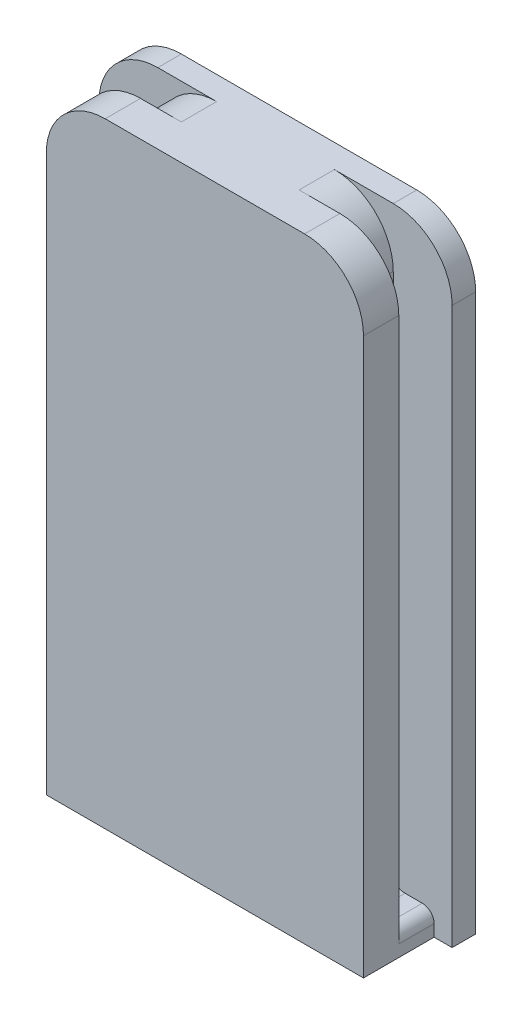
ISO-10303-21;
HEADER;
FILE_DESCRIPTION(('STEP AP214'),'2;1');
FILE_NAME('part.step','',(''),(''),'','','');
FILE_SCHEMA(('AUTOMOTIVE_DESIGN { 1 0 10303 214 1 1 1 1 }'));
ENDSEC;
DATA;
#1=APPLICATION_CONTEXT('core data for automotive mechanical design processes');
#2=APPLICATION_PROTOCOL_DEFINITION('international standard','automotive_design',2000,#1);
#3=PRODUCT_CONTEXT('',#1,'mechanical');
#4=PRODUCT('Part','Part','',(#3));
#5=PRODUCT_RELATED_PRODUCT_CATEGORY('part','',(#4));
#6=PRODUCT_DEFINITION_FORMATION('','',#4);
#7=PRODUCT_DEFINITION_CONTEXT('part definition',#1,'design');
#8=PRODUCT_DEFINITION('design','',#6,#7);
#9=PRODUCT_DEFINITION_SHAPE('','',#8);
#10=(LENGTH_UNIT() NAMED_UNIT(*) SI_UNIT(.MILLI.,.METRE.));
#11=(NAMED_UNIT(*) PLANE_ANGLE_UNIT() SI_UNIT($,.RADIAN.));
#12=(NAMED_UNIT(*) SI_UNIT($,.STERADIAN.) SOLID_ANGLE_UNIT());
#13=UNCERTAINTY_MEASURE_WITH_UNIT(LENGTH_MEASURE(1.E-05),#10,'distance_accuracy_value','');
#14=(GEOMETRIC_REPRESENTATION_CONTEXT(3) GLOBAL_UNCERTAINTY_ASSIGNED_CONTEXT((#13)) GLOBAL_UNIT_ASSIGNED_CONTEXT((#10,
#11,#12)) REPRESENTATION_CONTEXT('',''));
#15=CARTESIAN_POINT('',(0.,0.,0.));
#16=DIRECTION('',(0.,0.,1.));
#17=DIRECTION('',(1.,0.,0.));
#18=AXIS2_PLACEMENT_3D('',#15,#16,#17);
#19=CARTESIAN_POINT('',(-13.4701919815265,52.2437736392464,0.));
#20=DIRECTION('',(1.,0.,0.));
#21=DIRECTION('',(0.,0.,-1.));
#22=AXIS2_PLACEMENT_3D('',#19,#20,#21);
#23=PLANE('',#22);
#24=DIRECTION('',(0.,-1.,0.));
#25=VECTOR('',#24,1.);
#26=CARTESIAN_POINT('',(-13.4701919815265,52.2437736392464,0.));
#27=LINE('',#26,#25);
#28=CARTESIAN_POINT('',(-13.4701919815265,47.2437736392464,0.));
#29=VERTEX_POINT('',#28);
#30=CARTESIAN_POINT('',(-13.4701919815265,0.,0.));
#31=VERTEX_POINT('',#30);
#32=EDGE_CURVE('E265',#29,#31,#27,.T.);
#33=ORIENTED_EDGE('',*,*,#32,.F.);
#34=DIRECTION('',(0.,0.,1.));
#35=VECTOR('',#34,1.);
#36=CARTESIAN_POINT('',(-13.4701919815265,47.2437736392464,0.));
#37=LINE('',#36,#35);
#38=CARTESIAN_POINT('',(-13.4701919815265,47.2437736392464,-3.));
#39=VERTEX_POINT('',#38);
#40=EDGE_CURVE('E56',#29,#39,#37,.F.);
#41=ORIENTED_EDGE('',*,*,#40,.T.);
#42=DIRECTION('',(0.,-1.,0.));
#43=VECTOR('',#42,1.);
#44=CARTESIAN_POINT('',(-13.4701919815265,52.2437736392464,-3.));
#45=LINE('',#44,#43);
#46=CARTESIAN_POINT('',(-13.4701919815265,1.,-3.));
#47=VERTEX_POINT('',#46);
#48=EDGE_CURVE('E240',#39,#47,#45,.T.);
#49=ORIENTED_EDGE('',*,*,#48,.T.);
#50=DIRECTION('',(0.,0.,-1.));
#51=VECTOR('',#50,1.);
#52=CARTESIAN_POINT('',(-13.4701919815265,1.,-6.));
#53=LINE('',#52,#51);
#54=CARTESIAN_POINT('',(-13.4701919815265,1.,-6.));
#55=VERTEX_POINT('',#54);
#56=EDGE_CURVE('E326',#47,#55,#53,.T.);
#57=ORIENTED_EDGE('',*,*,#56,.T.);
#58=DIRECTION('',(0.,1.,0.));
#59=VECTOR('',#58,1.);
#60=CARTESIAN_POINT('',(-13.4701919815265,52.2437736392464,-6.));
#61=LINE('',#60,#59);
#62=CARTESIAN_POINT('',(-13.4701919815265,0.,-6.));
#63=VERTEX_POINT('',#62);
#64=EDGE_CURVE('E210',#63,#55,#61,.T.);
#65=ORIENTED_EDGE('',*,*,#64,.F.);
#66=DIRECTION('',(0.,0.,1.));
#67=VECTOR('',#66,1.);
#68=CARTESIAN_POINT('',(-13.4701919815265,0.,0.));
#69=LINE('',#68,#67);
#70=EDGE_CURVE('E453',#63,#31,#69,.T.);
#71=ORIENTED_EDGE('',*,*,#70,.T.);
#72=EDGE_LOOP('',(#33,#41,#49,#57,#65,#71));
#73=FACE_BOUND('',#72,.T.);
#74=ADVANCED_FACE('F33',(#73),#23,.F.);
#75=CARTESIAN_POINT('',(13.4701919815265,52.2437736392464,0.));
#76=DIRECTION('',(0.,0.,-1.));
#77=DIRECTION('',(-1.,0.,0.));
#78=AXIS2_PLACEMENT_3D('',#75,#76,#77);
#79=PLANE('',#78);
#80=DIRECTION('',(1.,0.,0.));
#81=VECTOR('',#80,1.);
#82=CARTESIAN_POINT('',(13.4701919815265,52.2437736392464,0.));
#83=LINE('',#82,#81);
#84=CARTESIAN_POINT('',(-8.47019198152647,52.2437736392464,0.));
#85=VERTEX_POINT('',#84);
#86=CARTESIAN_POINT('',(8.47019198152648,52.2437736392464,0.));
#87=VERTEX_POINT('',#86);
#88=EDGE_CURVE('E239',#85,#87,#83,.T.);
#89=ORIENTED_EDGE('',*,*,#88,.F.);
#90=CARTESIAN_POINT('',(-8.47019198152648,47.2437736392464,0.));
#91=DIRECTION('',(0.,0.,-1.));
#92=DIRECTION('',(-1.,0.,0.));
#93=AXIS2_PLACEMENT_3D('',#90,#91,#92);
#94=CIRCLE('',#93,5.);
#95=EDGE_CURVE('E356',#85,#29,#94,.F.);
#96=ORIENTED_EDGE('',*,*,#95,.T.);
#97=ORIENTED_EDGE('',*,*,#32,.T.);
#98=DIRECTION('',(1.,0.,0.));
#99=VECTOR('',#98,1.);
#100=CARTESIAN_POINT('',(13.4701919815265,0.,0.));
#101=LINE('',#100,#99);
#102=CARTESIAN_POINT('',(13.4701919815265,0.,0.));
#103=VERTEX_POINT('',#102);
#104=EDGE_CURVE('E220',#31,#103,#101,.T.);
#105=ORIENTED_EDGE('',*,*,#104,.T.);
#106=DIRECTION('',(0.,-1.,0.));
#107=VECTOR('',#106,1.);
#108=CARTESIAN_POINT('',(13.4701919815265,52.2437736392464,0.));
#109=LINE('',#108,#107);
#110=CARTESIAN_POINT('',(13.4701919815265,47.2437736392464,0.));
#111=VERTEX_POINT('',#110);
#112=EDGE_CURVE('E216',#111,#103,#109,.T.);
#113=ORIENTED_EDGE('',*,*,#112,.F.);
#114=CARTESIAN_POINT('',(8.47019198152648,47.2437736392464,0.));
#115=DIRECTION('',(0.,0.,-1.));
#116=DIRECTION('',(-1.,0.,0.));
#117=AXIS2_PLACEMENT_3D('',#114,#115,#116);
#118=CIRCLE('',#117,5.);
#119=EDGE_CURVE('E354',#111,#87,#118,.F.);
#120=ORIENTED_EDGE('',*,*,#119,.T.);
#121=EDGE_LOOP('',(#89,#96,#97,#105,#113,#120));
#122=FACE_BOUND('',#121,.T.);
#123=ADVANCED_FACE('F380',(#122),#79,.F.);
#124=CARTESIAN_POINT('',(13.4701919815265,52.2437736392464,0.));
#125=DIRECTION('',(-1.,0.,0.));
#126=DIRECTION('',(0.,0.,1.));
#127=AXIS2_PLACEMENT_3D('',#124,#125,#126);
#128=PLANE('',#127);
#129=DIRECTION('',(0.,-1.,0.));
#130=VECTOR('',#129,1.);
#131=CARTESIAN_POINT('',(13.4701919815265,52.2437736392464,-3.));
#132=LINE('',#131,#130);
#133=CARTESIAN_POINT('',(13.4701919815265,47.2437736392464,-3.));
#134=VERTEX_POINT('',#133);
#135=CARTESIAN_POINT('',(13.4701919815265,1.,-3.));
#136=VERTEX_POINT('',#135);
#137=EDGE_CURVE('E262',#134,#136,#132,.T.);
#138=ORIENTED_EDGE('',*,*,#137,.F.);
#139=DIRECTION('',(0.,0.,-1.));
#140=VECTOR('',#139,1.);
#141=CARTESIAN_POINT('',(13.4701919815265,47.2437736392464,0.));
#142=LINE('',#141,#140);
#143=EDGE_CURVE('E362',#134,#111,#142,.F.);
#144=ORIENTED_EDGE('',*,*,#143,.T.);
#145=ORIENTED_EDGE('',*,*,#112,.T.);
#146=DIRECTION('',(0.,0.,-1.));
#147=VECTOR('',#146,1.);
#148=CARTESIAN_POINT('',(13.4701919815265,0.,0.));
#149=LINE('',#148,#147);
#150=CARTESIAN_POINT('',(13.4701919815265,0.,-6.));
#151=VERTEX_POINT('',#150);
#152=EDGE_CURVE('E213',#103,#151,#149,.T.);
#153=ORIENTED_EDGE('',*,*,#152,.T.);
#154=DIRECTION('',(0.,-1.,0.));
#155=VECTOR('',#154,1.);
#156=CARTESIAN_POINT('',(13.4701919815265,52.2437736392464,-6.));
#157=LINE('',#156,#155);
#158=CARTESIAN_POINT('',(13.4701919815265,1.,-6.));
#159=VERTEX_POINT('',#158);
#160=EDGE_CURVE('E195',#159,#151,#157,.T.);
#161=ORIENTED_EDGE('',*,*,#160,.F.);
#162=DIRECTION('',(0.,0.,1.));
#163=VECTOR('',#162,1.);
#164=CARTESIAN_POINT('',(13.4701919815265,1.,-3.));
#165=LINE('',#164,#163);
#166=EDGE_CURVE('E313',#159,#136,#165,.T.);
#167=ORIENTED_EDGE('',*,*,#166,.T.);
#168=EDGE_LOOP('',(#138,#144,#145,#153,#161,#167));
#169=FACE_BOUND('',#168,.T.);
#170=ADVANCED_FACE('F214',(#169),#128,.F.);
#171=CARTESIAN_POINT('',(13.4701919815265,52.2437736392464,-3.));
#172=DIRECTION('',(0.,0.,1.));
#173=DIRECTION('',(1.,0.,0.));
#174=AXIS2_PLACEMENT_3D('',#171,#172,#173);
#175=PLANE('',#174);
#176=DIRECTION('',(-1.,0.,0.));
#177=VECTOR('',#176,1.);
#178=CARTESIAN_POINT('',(13.4701919815265,52.2437736392464,-3.));
#179=LINE('',#178,#177);
#180=CARTESIAN_POINT('',(8.47019198152648,52.2437736392464,-3.));
#181=VERTEX_POINT('',#180);
#182=CARTESIAN_POINT('',(5.,52.2437736392464,-2.99999999999999));
#183=VERTEX_POINT('',#182);
#184=EDGE_CURVE('E442',#181,#183,#179,.T.);
#185=ORIENTED_EDGE('',*,*,#184,.F.);
#186=CARTESIAN_POINT('',(8.47019198152648,47.2437736392464,-3.));
#187=DIRECTION('',(0.,0.,1.));
#188=DIRECTION('',(1.,0.,0.));
#189=AXIS2_PLACEMENT_3D('',#186,#187,#188);
#190=CIRCLE('',#189,5.);
#191=EDGE_CURVE('E48',#181,#134,#190,.F.);
#192=ORIENTED_EDGE('',*,*,#191,.T.);
#193=ORIENTED_EDGE('',*,*,#137,.T.);
#194=CARTESIAN_POINT('',(12.4701919815265,1.,-3.));
#195=DIRECTION('',(0.,0.,1.));
#196=DIRECTION('',(1.,0.,0.));
#197=AXIS2_PLACEMENT_3D('',#194,#195,#196);
#198=CIRCLE('',#197,1.);
#199=CARTESIAN_POINT('',(12.4701919815265,2.,-3.));
#200=VERTEX_POINT('',#199);
#201=EDGE_CURVE('E340',#136,#200,#198,.T.);
#202=ORIENTED_EDGE('',*,*,#201,.T.);
#203=DIRECTION('',(-1.,0.,0.));
#204=VECTOR('',#203,1.);
#205=CARTESIAN_POINT('',(13.4701919815265,2.,-3.));
#206=LINE('',#205,#204);
#207=CARTESIAN_POINT('',(11.,2.,-3.));
#208=VERTEX_POINT('',#207);
#209=EDGE_CURVE('E447',#200,#208,#206,.T.);
#210=ORIENTED_EDGE('',*,*,#209,.T.);
#211=CARTESIAN_POINT('',(11.,3.,-3.));
#212=DIRECTION('',(0.,0.,1.));
#213=DIRECTION('',(1.,0.,0.));
#214=AXIS2_PLACEMENT_3D('',#211,#212,#213);
#215=CIRCLE('',#214,1.);
#216=CARTESIAN_POINT('',(10.,3.,-3.));
#217=VERTEX_POINT('',#216);
#218=EDGE_CURVE('E324',#208,#217,#215,.F.);
#219=ORIENTED_EDGE('',*,*,#218,.T.);
#220=DIRECTION('',(0.,-1.,0.));
#221=VECTOR('',#220,1.);
#222=CARTESIAN_POINT('',(10.,52.2437736392464,-3.));
#223=LINE('',#222,#221);
#224=CARTESIAN_POINT('',(10.,47.2437736392464,-3.));
#225=VERTEX_POINT('',#224);
#226=EDGE_CURVE('E259',#225,#217,#223,.T.);
#227=ORIENTED_EDGE('',*,*,#226,.F.);
#228=CARTESIAN_POINT('',(5.,47.2437736392464,-2.99999999999999));
#229=DIRECTION('',(0.,0.,1.));
#230=DIRECTION('',(1.,0.,0.));
#231=AXIS2_PLACEMENT_3D('',#228,#229,#230);
#232=CIRCLE('',#231,5.);
#233=EDGE_CURVE('E306',#225,#183,#232,.T.);
#234=ORIENTED_EDGE('',*,*,#233,.T.);
#235=EDGE_LOOP('',(#185,#192,#193,#202,#210,#219,#227,#234));
#236=FACE_BOUND('',#235,.T.);
#237=ADVANCED_FACE('F471',(#236),#175,.F.);
#238=CARTESIAN_POINT('',(10.,52.2437736392464,-3.));
#239=DIRECTION('',(-1.,0.,0.));
#240=DIRECTION('',(0.,0.,1.));
#241=AXIS2_PLACEMENT_3D('',#238,#239,#240);
#242=PLANE('',#241);
#243=ORIENTED_EDGE('',*,*,#226,.T.);
#244=DIRECTION('',(0.,0.,-1.));
#245=VECTOR('',#244,1.);
#246=CARTESIAN_POINT('',(10.,3.,-3.));
#247=LINE('',#246,#245);
#248=CARTESIAN_POINT('',(10.,3.,-6.));
#249=VERTEX_POINT('',#248);
#250=EDGE_CURVE('E319',#217,#249,#247,.T.);
#251=ORIENTED_EDGE('',*,*,#250,.T.);
#252=DIRECTION('',(0.,-1.,0.));
#253=VECTOR('',#252,1.);
#254=CARTESIAN_POINT('',(10.,52.2437736392464,-6.));
#255=LINE('',#254,#253);
#256=CARTESIAN_POINT('',(10.,47.2437736392464,-6.));
#257=VERTEX_POINT('',#256);
#258=EDGE_CURVE('E257',#257,#249,#255,.T.);
#259=ORIENTED_EDGE('',*,*,#258,.F.);
#260=DIRECTION('',(0.,0.,-1.));
#261=VECTOR('',#260,1.);
#262=CARTESIAN_POINT('',(10.,47.2437736392464,-3.));
#263=LINE('',#262,#261);
#264=EDGE_CURVE('E300',#257,#225,#263,.F.);
#265=ORIENTED_EDGE('',*,*,#264,.T.);
#266=EDGE_LOOP('',(#243,#251,#259,#265));
#267=FACE_BOUND('',#266,.T.);
#268=ADVANCED_FACE('F480',(#267),#242,.F.);
#269=CARTESIAN_POINT('',(10.,52.2437736392464,-6.));
#270=DIRECTION('',(0.,0.,-1.));
#271=DIRECTION('',(-1.,0.,0.));
#272=AXIS2_PLACEMENT_3D('',#269,#270,#271);
#273=PLANE('',#272);
#274=ORIENTED_EDGE('',*,*,#258,.T.);
#275=CARTESIAN_POINT('',(11.,3.,-6.));
#276=DIRECTION('',(0.,0.,-1.));
#277=DIRECTION('',(-1.,0.,0.));
#278=AXIS2_PLACEMENT_3D('',#275,#276,#277);
#279=CIRCLE('',#278,1.);
#280=CARTESIAN_POINT('',(11.,2.,-6.));
#281=VERTEX_POINT('',#280);
#282=EDGE_CURVE('E322',#249,#281,#279,.F.);
#283=ORIENTED_EDGE('',*,*,#282,.T.);
#284=DIRECTION('',(1.,0.,0.));
#285=VECTOR('',#284,1.);
#286=CARTESIAN_POINT('',(10.,2.,-6.));
#287=LINE('',#286,#285);
#288=CARTESIAN_POINT('',(12.4701919815265,2.,-6.));
#289=VERTEX_POINT('',#288);
#290=EDGE_CURVE('E466',#281,#289,#287,.T.);
#291=ORIENTED_EDGE('',*,*,#290,.T.);
#292=CARTESIAN_POINT('',(12.4701919815265,1.,-6.));
#293=DIRECTION('',(0.,0.,-1.));
#294=DIRECTION('',(-1.,0.,0.));
#295=AXIS2_PLACEMENT_3D('',#292,#293,#294);
#296=CIRCLE('',#295,1.);
#297=EDGE_CURVE('E205',#289,#159,#296,.T.);
#298=ORIENTED_EDGE('',*,*,#297,.T.);
#299=ORIENTED_EDGE('',*,*,#160,.T.);
#300=DIRECTION('',(1.,0.,0.));
#301=VECTOR('',#300,1.);
#302=CARTESIAN_POINT('',(10.,0.,-6.));
#303=LINE('',#302,#301);
#304=CARTESIAN_POINT('',(15.,0.,-5.99999999999999));
#305=VERTEX_POINT('',#304);
#306=EDGE_CURVE('E201',#151,#305,#303,.T.);
#307=ORIENTED_EDGE('',*,*,#306,.T.);
#308=DIRECTION('',(0.,-1.,0.));
#309=VECTOR('',#308,1.);
#310=CARTESIAN_POINT('',(15.,52.2437736392464,-5.99999999999999));
#311=LINE('',#310,#309);
#312=CARTESIAN_POINT('',(15.,47.2437736392464,-5.99999999999999));
#313=VERTEX_POINT('',#312);
#314=EDGE_CURVE('E255',#313,#305,#311,.T.);
#315=ORIENTED_EDGE('',*,*,#314,.F.);
#316=CARTESIAN_POINT('',(10.,47.2437736392464,-6.));
#317=DIRECTION('',(0.,0.,-1.));
#318=DIRECTION('',(-1.,0.,0.));
#319=AXIS2_PLACEMENT_3D('',#316,#317,#318);
#320=CIRCLE('',#319,5.);
#321=CARTESIAN_POINT('',(10.,52.2437736392464,-6.));
#322=VERTEX_POINT('',#321);
#323=EDGE_CURVE('E298',#313,#322,#320,.F.);
#324=ORIENTED_EDGE('',*,*,#323,.T.);
#325=DIRECTION('',(1.,0.,0.));
#326=VECTOR('',#325,1.);
#327=CARTESIAN_POINT('',(10.,52.2437736392464,-6.));
#328=LINE('',#327,#326);
#329=CARTESIAN_POINT('',(5.,52.2437736392464,-6.));
#330=VERTEX_POINT('',#329);
#331=EDGE_CURVE('E282',#330,#322,#328,.T.);
#332=ORIENTED_EDGE('',*,*,#331,.F.);
#333=CARTESIAN_POINT('',(5.,47.2437736392464,-6.));
#334=DIRECTION('',(0.,0.,-1.));
#335=DIRECTION('',(-1.,0.,0.));
#336=AXIS2_PLACEMENT_3D('',#333,#334,#335);
#337=CIRCLE('',#336,5.);
#338=EDGE_CURVE('E304',#330,#257,#337,.T.);
#339=ORIENTED_EDGE('',*,*,#338,.T.);
#340=EDGE_LOOP('',(#274,#283,#291,#298,#299,#307,#315,#324,#332,#339));
#341=FACE_BOUND('',#340,.T.);
#342=ADVANCED_FACE('F198',(#341),#273,.F.);
#343=CARTESIAN_POINT('',(15.,52.2437736392464,-5.99999999999999));
#344=DIRECTION('',(-1.,0.,0.));
#345=DIRECTION('',(0.,0.,1.));
#346=AXIS2_PLACEMENT_3D('',#343,#344,#345);
#347=PLANE('',#346);
#348=DIRECTION('',(0.,-1.,0.));
#349=VECTOR('',#348,1.);
#350=CARTESIAN_POINT('',(15.,52.2437736392464,-7.99999999999999));
#351=LINE('',#350,#349);
#352=CARTESIAN_POINT('',(15.,47.2437736392464,-7.99999999999999));
#353=VERTEX_POINT('',#352);
#354=CARTESIAN_POINT('',(15.,0.,-7.99999999999999));
#355=VERTEX_POINT('',#354);
#356=EDGE_CURVE('E253',#353,#355,#351,.T.);
#357=ORIENTED_EDGE('',*,*,#356,.F.);
#358=DIRECTION('',(0.,0.,-1.));
#359=VECTOR('',#358,1.);
#360=CARTESIAN_POINT('',(15.,47.2437736392464,-5.99999999999999));
#361=LINE('',#360,#359);
#362=EDGE_CURVE('E296',#353,#313,#361,.F.);
#363=ORIENTED_EDGE('',*,*,#362,.T.);
#364=ORIENTED_EDGE('',*,*,#314,.T.);
#365=DIRECTION('',(0.,0.,-1.));
#366=VECTOR('',#365,1.);
#367=CARTESIAN_POINT('',(15.,0.,-5.99999999999999));
#368=LINE('',#367,#366);
#369=EDGE_CURVE('E225',#305,#355,#368,.T.);
#370=ORIENTED_EDGE('',*,*,#369,.T.);
#371=EDGE_LOOP('',(#357,#363,#364,#370));
#372=FACE_BOUND('',#371,.T.);
#373=ADVANCED_FACE('F494',(#372),#347,.F.);
#374=CARTESIAN_POINT('',(-15.,52.2437736392464,-7.99999999999999));
#375=DIRECTION('',(0.,0.,1.));
#376=DIRECTION('',(1.,0.,0.));
#377=AXIS2_PLACEMENT_3D('',#374,#375,#376);
#378=PLANE('',#377);
#379=CARTESIAN_POINT('',(0.,32.,-7.99999999999999));
#380=DIRECTION('',(0.,0.,1.));
#381=DIRECTION('',(1.,0.,0.));
#382=AXIS2_PLACEMENT_3D('',#379,#380,#381);
#383=CIRCLE('',#382,7.50809002919966);
#384=CARTESIAN_POINT('',(7.50809002919966,32.,-7.99999999999999));
#385=VERTEX_POINT('',#384);
#386=EDGE_CURVE('E364',#385,#385,#383,.T.);
#387=ORIENTED_EDGE('',*,*,#386,.T.);
#388=EDGE_LOOP('',(#387));
#389=FACE_BOUND('',#388,.T.);
#390=DIRECTION('',(0.,-1.,0.));
#391=VECTOR('',#390,1.);
#392=CARTESIAN_POINT('',(-15.,52.2437736392464,-7.99999999999999));
#393=LINE('',#392,#391);
#394=CARTESIAN_POINT('',(-15.,47.2437736392464,-7.99999999999999));
#395=VERTEX_POINT('',#394);
#396=CARTESIAN_POINT('',(-15.,0.,-7.99999999999999));
#397=VERTEX_POINT('',#396);
#398=EDGE_CURVE('E251',#395,#397,#393,.T.);
#399=ORIENTED_EDGE('',*,*,#398,.F.);
#400=CARTESIAN_POINT('',(-10.,47.2437736392464,-7.99999999999999));
#401=DIRECTION('',(0.,0.,1.));
#402=DIRECTION('',(1.,0.,0.));
#403=AXIS2_PLACEMENT_3D('',#400,#401,#402);
#404=CIRCLE('',#403,5.);
#405=CARTESIAN_POINT('',(-10.,52.2437736392464,-7.99999999999999));
#406=VERTEX_POINT('',#405);
#407=EDGE_CURVE('E294',#395,#406,#404,.F.);
#408=ORIENTED_EDGE('',*,*,#407,.T.);
#409=DIRECTION('',(-1.,0.,0.));
#410=VECTOR('',#409,1.);
#411=CARTESIAN_POINT('',(-15.,52.2437736392464,-7.99999999999999));
#412=LINE('',#411,#410);
#413=CARTESIAN_POINT('',(10.,52.2437736392464,-7.99999999999999));
#414=VERTEX_POINT('',#413);
#415=EDGE_CURVE('E444',#414,#406,#412,.T.);
#416=ORIENTED_EDGE('',*,*,#415,.F.);
#417=CARTESIAN_POINT('',(10.,47.2437736392464,-7.99999999999999));
#418=DIRECTION('',(0.,0.,1.));
#419=DIRECTION('',(1.,0.,0.));
#420=AXIS2_PLACEMENT_3D('',#417,#418,#419);
#421=CIRCLE('',#420,5.);
#422=EDGE_CURVE('E292',#414,#353,#421,.F.);
#423=ORIENTED_EDGE('',*,*,#422,.T.);
#424=ORIENTED_EDGE('',*,*,#356,.T.);
#425=DIRECTION('',(-1.,0.,0.));
#426=VECTOR('',#425,1.);
#427=CARTESIAN_POINT('',(-15.,0.,-7.99999999999999));
#428=LINE('',#427,#426);
#429=EDGE_CURVE('E227',#355,#397,#428,.T.);
#430=ORIENTED_EDGE('',*,*,#429,.T.);
#431=EDGE_LOOP('',(#399,#408,#416,#423,#424,#430));
#432=FACE_BOUND('',#431,.T.);
#433=ADVANCED_FACE('F492',(#389,#432),#378,.F.);
#434=CARTESIAN_POINT('',(-15.,52.2437736392464,-5.99999999999999));
#435=DIRECTION('',(1.,0.,0.));
#436=DIRECTION('',(0.,0.,-1.));
#437=AXIS2_PLACEMENT_3D('',#434,#435,#436);
#438=PLANE('',#437);
#439=DIRECTION('',(0.,-1.,0.));
#440=VECTOR('',#439,1.);
#441=CARTESIAN_POINT('',(-15.,52.2437736392464,-5.99999999999999));
#442=LINE('',#441,#440);
#443=CARTESIAN_POINT('',(-15.,47.2437736392464,-5.99999999999999));
#444=VERTEX_POINT('',#443);
#445=CARTESIAN_POINT('',(-15.,0.,-5.99999999999999));
#446=VERTEX_POINT('',#445);
#447=EDGE_CURVE('E249',#444,#446,#442,.T.);
#448=ORIENTED_EDGE('',*,*,#447,.F.);
#449=DIRECTION('',(0.,0.,1.));
#450=VECTOR('',#449,1.);
#451=CARTESIAN_POINT('',(-15.,47.2437736392464,-5.99999999999999));
#452=LINE('',#451,#450);
#453=EDGE_CURVE('E290',#444,#395,#452,.F.);
#454=ORIENTED_EDGE('',*,*,#453,.T.);
#455=ORIENTED_EDGE('',*,*,#398,.T.);
#456=DIRECTION('',(0.,0.,1.));
#457=VECTOR('',#456,1.);
#458=CARTESIAN_POINT('',(-15.,0.,-5.99999999999999));
#459=LINE('',#458,#457);
#460=EDGE_CURVE('E233',#397,#446,#459,.T.);
#461=ORIENTED_EDGE('',*,*,#460,.T.);
#462=EDGE_LOOP('',(#448,#454,#455,#461));
#463=FACE_BOUND('',#462,.T.);
#464=ADVANCED_FACE('F536',(#463),#438,.F.);
#465=CARTESIAN_POINT('',(-10.,52.2437736392464,-6.));
#466=DIRECTION('',(0.,0.,-1.));
#467=DIRECTION('',(-1.,0.,0.));
#468=AXIS2_PLACEMENT_3D('',#465,#466,#467);
#469=PLANE('',#468);
#470=DIRECTION('',(1.,0.,0.));
#471=VECTOR('',#470,1.);
#472=CARTESIAN_POINT('',(-10.,2.,-6.));
#473=LINE('',#472,#471);
#474=CARTESIAN_POINT('',(-12.4701919815265,2.,-6.));
#475=VERTEX_POINT('',#474);
#476=CARTESIAN_POINT('',(-11.,2.,-6.));
#477=VERTEX_POINT('',#476);
#478=EDGE_CURVE('E209',#475,#477,#473,.T.);
#479=ORIENTED_EDGE('',*,*,#478,.T.);
#480=CARTESIAN_POINT('',(-11.,3.,-6.));
#481=DIRECTION('',(0.,0.,-1.));
#482=DIRECTION('',(-1.,0.,0.));
#483=AXIS2_PLACEMENT_3D('',#480,#481,#482);
#484=CIRCLE('',#483,1.);
#485=CARTESIAN_POINT('',(-10.,3.,-6.));
#486=VERTEX_POINT('',#485);
#487=EDGE_CURVE('E338',#477,#486,#484,.F.);
#488=ORIENTED_EDGE('',*,*,#487,.T.);
#489=DIRECTION('',(0.,-1.,0.));
#490=VECTOR('',#489,1.);
#491=CARTESIAN_POINT('',(-10.,52.2437736392464,-6.));
#492=LINE('',#491,#490);
#493=CARTESIAN_POINT('',(-10.,47.2437736392464,-6.));
#494=VERTEX_POINT('',#493);
#495=EDGE_CURVE('E246',#494,#486,#492,.T.);
#496=ORIENTED_EDGE('',*,*,#495,.F.);
#497=CARTESIAN_POINT('',(-5.,47.2437736392464,-6.));
#498=DIRECTION('',(0.,0.,-1.));
#499=DIRECTION('',(-1.,0.,0.));
#500=AXIS2_PLACEMENT_3D('',#497,#498,#499);
#501=CIRCLE('',#500,5.);
#502=CARTESIAN_POINT('',(-5.,52.2437736392464,-6.));
#503=VERTEX_POINT('',#502);
#504=EDGE_CURVE('E311',#494,#503,#501,.T.);
#505=ORIENTED_EDGE('',*,*,#504,.T.);
#506=DIRECTION('',(1.,0.,0.));
#507=VECTOR('',#506,1.);
#508=CARTESIAN_POINT('',(-10.,52.2437736392464,-6.));
#509=LINE('',#508,#507);
#510=CARTESIAN_POINT('',(-10.,52.2437736392464,-6.));
#511=VERTEX_POINT('',#510);
#512=EDGE_CURVE('E270',#511,#503,#509,.T.);
#513=ORIENTED_EDGE('',*,*,#512,.F.);
#514=CARTESIAN_POINT('',(-10.,47.2437736392464,-6.));
#515=DIRECTION('',(0.,0.,-1.));
#516=DIRECTION('',(-1.,0.,0.));
#517=AXIS2_PLACEMENT_3D('',#514,#515,#516);
#518=CIRCLE('',#517,5.);
#519=EDGE_CURVE('E288',#511,#444,#518,.F.);
#520=ORIENTED_EDGE('',*,*,#519,.T.);
#521=ORIENTED_EDGE('',*,*,#447,.T.);
#522=DIRECTION('',(1.,0.,0.));
#523=VECTOR('',#522,1.);
#524=CARTESIAN_POINT('',(-10.,0.,-6.));
#525=LINE('',#524,#523);
#526=EDGE_CURVE('E236',#446,#63,#525,.T.);
#527=ORIENTED_EDGE('',*,*,#526,.T.);
#528=ORIENTED_EDGE('',*,*,#64,.T.);
#529=CARTESIAN_POINT('',(-12.4701919815265,1.,-6.));
#530=DIRECTION('',(0.,0.,-1.));
#531=DIRECTION('',(-1.,0.,0.));
#532=AXIS2_PLACEMENT_3D('',#529,#530,#531);
#533=CIRCLE('',#532,1.);
#534=EDGE_CURVE('E343',#55,#475,#533,.T.);
#535=ORIENTED_EDGE('',*,*,#534,.T.);
#536=EDGE_LOOP('',(#479,#488,#496,#505,#513,#520,#521,#527,#528,#535));
#537=FACE_BOUND('',#536,.T.);
#538=ADVANCED_FACE('F461',(#537),#469,.F.);
#539=CARTESIAN_POINT('',(-10.,52.2437736392464,-3.));
#540=DIRECTION('',(1.,0.,0.));
#541=DIRECTION('',(0.,0.,-1.));
#542=AXIS2_PLACEMENT_3D('',#539,#540,#541);
#543=PLANE('',#542);
#544=ORIENTED_EDGE('',*,*,#495,.T.);
#545=DIRECTION('',(0.,0.,1.));
#546=VECTOR('',#545,1.);
#547=CARTESIAN_POINT('',(-10.,3.,-3.));
#548=LINE('',#547,#546);
#549=CARTESIAN_POINT('',(-10.,3.,-3.));
#550=VERTEX_POINT('',#549);
#551=EDGE_CURVE('E333',#486,#550,#548,.T.);
#552=ORIENTED_EDGE('',*,*,#551,.T.);
#553=DIRECTION('',(0.,-1.,0.));
#554=VECTOR('',#553,1.);
#555=CARTESIAN_POINT('',(-10.,52.2437736392464,-3.));
#556=LINE('',#555,#554);
#557=CARTESIAN_POINT('',(-10.,47.2437736392464,-3.));
#558=VERTEX_POINT('',#557);
#559=EDGE_CURVE('E242',#558,#550,#556,.T.);
#560=ORIENTED_EDGE('',*,*,#559,.F.);
#561=DIRECTION('',(0.,0.,1.));
#562=VECTOR('',#561,1.);
#563=CARTESIAN_POINT('',(-10.,47.2437736392464,-3.));
#564=LINE('',#563,#562);
#565=EDGE_CURVE('E302',#558,#494,#564,.F.);
#566=ORIENTED_EDGE('',*,*,#565,.T.);
#567=EDGE_LOOP('',(#544,#552,#560,#566));
#568=FACE_BOUND('',#567,.T.);
#569=ADVANCED_FACE('F508',(#568),#543,.F.);
#570=CARTESIAN_POINT('',(-13.4701919815265,52.2437736392464,-3.));
#571=DIRECTION('',(0.,0.,1.));
#572=DIRECTION('',(1.,0.,0.));
#573=AXIS2_PLACEMENT_3D('',#570,#571,#572);
#574=PLANE('',#573);
#575=ORIENTED_EDGE('',*,*,#48,.F.);
#576=CARTESIAN_POINT('',(-8.47019198152648,47.2437736392464,-3.));
#577=DIRECTION('',(0.,0.,1.));
#578=DIRECTION('',(1.,0.,0.));
#579=AXIS2_PLACEMENT_3D('',#576,#577,#578);
#580=CIRCLE('',#579,5.);
#581=CARTESIAN_POINT('',(-8.47019198152648,52.2437736392464,-3.));
#582=VERTEX_POINT('',#581);
#583=EDGE_CURVE('E359',#39,#582,#580,.F.);
#584=ORIENTED_EDGE('',*,*,#583,.T.);
#585=DIRECTION('',(-1.,0.,0.));
#586=VECTOR('',#585,1.);
#587=CARTESIAN_POINT('',(-13.4701919815265,52.2437736392464,-3.));
#588=LINE('',#587,#586);
#589=CARTESIAN_POINT('',(-5.,52.2437736392464,-2.99999999999999));
#590=VERTEX_POINT('',#589);
#591=EDGE_CURVE('E243',#590,#582,#588,.T.);
#592=ORIENTED_EDGE('',*,*,#591,.F.);
#593=CARTESIAN_POINT('',(-5.,47.2437736392464,-2.99999999999999));
#594=DIRECTION('',(0.,0.,1.));
#595=DIRECTION('',(1.,0.,0.));
#596=AXIS2_PLACEMENT_3D('',#593,#594,#595);
#597=CIRCLE('',#596,5.);
#598=EDGE_CURVE('E309',#590,#558,#597,.T.);
#599=ORIENTED_EDGE('',*,*,#598,.T.);
#600=ORIENTED_EDGE('',*,*,#559,.T.);
#601=CARTESIAN_POINT('',(-11.,3.,-3.));
#602=DIRECTION('',(0.,0.,1.));
#603=DIRECTION('',(1.,0.,0.));
#604=AXIS2_PLACEMENT_3D('',#601,#602,#603);
#605=CIRCLE('',#604,1.);
#606=CARTESIAN_POINT('',(-11.,2.,-3.));
#607=VERTEX_POINT('',#606);
#608=EDGE_CURVE('E336',#550,#607,#605,.F.);
#609=ORIENTED_EDGE('',*,*,#608,.T.);
#610=DIRECTION('',(-1.,0.,0.));
#611=VECTOR('',#610,1.);
#612=CARTESIAN_POINT('',(-13.4701919815265,2.,-3.));
#613=LINE('',#612,#611);
#614=CARTESIAN_POINT('',(-12.4701919815265,2.,-3.));
#615=VERTEX_POINT('',#614);
#616=EDGE_CURVE('E267',#607,#615,#613,.T.);
#617=ORIENTED_EDGE('',*,*,#616,.T.);
#618=CARTESIAN_POINT('',(-12.4701919815265,1.,-3.));
#619=DIRECTION('',(0.,0.,1.));
#620=DIRECTION('',(1.,0.,0.));
#621=AXIS2_PLACEMENT_3D('',#618,#619,#620);
#622=CIRCLE('',#621,1.);
#623=EDGE_CURVE('E345',#615,#47,#622,.T.);
#624=ORIENTED_EDGE('',*,*,#623,.T.);
#625=EDGE_LOOP('',(#575,#584,#592,#599,#600,#609,#617,#624));
#626=FACE_BOUND('',#625,.T.);
#627=ADVANCED_FACE('F506',(#626),#574,.F.);
#628=CARTESIAN_POINT('',(0.,52.2437736392464,0.));
#629=DIRECTION('',(0.,-1.,0.));
#630=DIRECTION('',(0.,0.,-1.));
#631=AXIS2_PLACEMENT_3D('',#628,#629,#630);
#632=PLANE('',#631);
#633=ORIENTED_EDGE('',*,*,#591,.T.);
#634=DIRECTION('',(0.,0.,1.));
#635=VECTOR('',#634,1.);
#636=CARTESIAN_POINT('',(-8.47019198152648,52.2437736392464,0.));
#637=LINE('',#636,#635);
#638=EDGE_CURVE('E351',#582,#85,#637,.T.);
#639=ORIENTED_EDGE('',*,*,#638,.T.);
#640=ORIENTED_EDGE('',*,*,#88,.T.);
#641=DIRECTION('',(0.,0.,-1.));
#642=VECTOR('',#641,1.);
#643=CARTESIAN_POINT('',(8.47019198152648,52.2437736392464,0.));
#644=LINE('',#643,#642);
#645=EDGE_CURVE('E348',#87,#181,#644,.T.);
#646=ORIENTED_EDGE('',*,*,#645,.T.);
#647=ORIENTED_EDGE('',*,*,#184,.T.);
#648=DIRECTION('',(0.,0.,-1.));
#649=VECTOR('',#648,1.);
#650=CARTESIAN_POINT('',(5.,52.2437736392464,0.));
#651=LINE('',#650,#649);
#652=EDGE_CURVE('E279',#183,#330,#651,.T.);
#653=ORIENTED_EDGE('',*,*,#652,.T.);
#654=ORIENTED_EDGE('',*,*,#331,.T.);
#655=DIRECTION('',(0.,0.,-1.));
#656=VECTOR('',#655,1.);
#657=CARTESIAN_POINT('',(10.,52.2437736392464,0.));
#658=LINE('',#657,#656);
#659=EDGE_CURVE('E285',#322,#414,#658,.T.);
#660=ORIENTED_EDGE('',*,*,#659,.T.);
#661=ORIENTED_EDGE('',*,*,#415,.T.);
#662=DIRECTION('',(0.,0.,1.));
#663=VECTOR('',#662,1.);
#664=CARTESIAN_POINT('',(-10.,52.2437736392464,0.));
#665=LINE('',#664,#663);
#666=EDGE_CURVE('E276',#406,#511,#665,.T.);
#667=ORIENTED_EDGE('',*,*,#666,.T.);
#668=ORIENTED_EDGE('',*,*,#512,.T.);
#669=DIRECTION('',(0.,0.,1.));
#670=VECTOR('',#669,1.);
#671=CARTESIAN_POINT('',(-5.,52.2437736392464,0.));
#672=LINE('',#671,#670);
#673=EDGE_CURVE('E273',#503,#590,#672,.T.);
#674=ORIENTED_EDGE('',*,*,#673,.T.);
#675=EDGE_LOOP('',(#633,#639,#640,#646,#647,#653,#654,#660,#661,#667,#668,#674));
#676=FACE_BOUND('',#675,.T.);
#677=ADVANCED_FACE('F440',(#676),#632,.F.);
#678=CARTESIAN_POINT('',(0.,0.,0.));
#679=DIRECTION('',(0.,-1.,0.));
#680=DIRECTION('',(0.,0.,-1.));
#681=AXIS2_PLACEMENT_3D('',#678,#679,#680);
#682=PLANE('',#681);
#683=ORIENTED_EDGE('',*,*,#306,.F.);
#684=ORIENTED_EDGE('',*,*,#152,.F.);
#685=ORIENTED_EDGE('',*,*,#104,.F.);
#686=ORIENTED_EDGE('',*,*,#70,.F.);
#687=ORIENTED_EDGE('',*,*,#526,.F.);
#688=ORIENTED_EDGE('',*,*,#460,.F.);
#689=ORIENTED_EDGE('',*,*,#429,.F.);
#690=ORIENTED_EDGE('',*,*,#369,.F.);
#691=EDGE_LOOP('',(#683,#684,#685,#686,#687,#688,#689,#690));
#692=FACE_BOUND('',#691,.T.);
#693=ADVANCED_FACE('F222',(#692),#682,.T.);
#694=CARTESIAN_POINT('',(0.,2.,0.));
#695=DIRECTION('',(0.,1.,0.));
#696=DIRECTION('',(0.,0.,1.));
#697=AXIS2_PLACEMENT_3D('',#694,#695,#696);
#698=PLANE('',#697);
#699=ORIENTED_EDGE('',*,*,#478,.F.);
#700=DIRECTION('',(0.,0.,-1.));
#701=VECTOR('',#700,1.);
#702=CARTESIAN_POINT('',(-12.4701919815265,2.,-3.));
#703=LINE('',#702,#701);
#704=EDGE_CURVE('E331',#475,#615,#703,.F.);
#705=ORIENTED_EDGE('',*,*,#704,.T.);
#706=ORIENTED_EDGE('',*,*,#616,.F.);
#707=DIRECTION('',(0.,0.,1.));
#708=VECTOR('',#707,1.);
#709=CARTESIAN_POINT('',(-11.,2.,0.));
#710=LINE('',#709,#708);
#711=EDGE_CURVE('E329',#607,#477,#710,.F.);
#712=ORIENTED_EDGE('',*,*,#711,.T.);
#713=EDGE_LOOP('',(#699,#705,#706,#712));
#714=FACE_BOUND('',#713,.T.);
#715=ADVANCED_FACE('F517',(#714),#698,.T.);
#716=ORIENTED_EDGE('',*,*,#209,.F.);
#717=DIRECTION('',(0.,0.,1.));
#718=VECTOR('',#717,1.);
#719=CARTESIAN_POINT('',(12.4701919815265,2.,-6.));
#720=LINE('',#719,#718);
#721=EDGE_CURVE('E317',#200,#289,#720,.F.);
#722=ORIENTED_EDGE('',*,*,#721,.T.);
#723=ORIENTED_EDGE('',*,*,#290,.F.);
#724=DIRECTION('',(0.,0.,-1.));
#725=VECTOR('',#724,1.);
#726=CARTESIAN_POINT('',(11.,2.,0.));
#727=LINE('',#726,#725);
#728=EDGE_CURVE('E315',#281,#208,#727,.F.);
#729=ORIENTED_EDGE('',*,*,#728,.T.);
#730=EDGE_LOOP('',(#716,#722,#723,#729));
#731=FACE_BOUND('',#730,.T.);
#732=ADVANCED_FACE('F393',(#731),#698,.T.);
#733=CARTESIAN_POINT('',(-10.,47.2437736392464,0.));
#734=DIRECTION('',(0.,0.,1.));
#735=DIRECTION('',(1.,0.,0.));
#736=AXIS2_PLACEMENT_3D('',#733,#734,#735);
#737=CYLINDRICAL_SURFACE('',#736,5.);
#738=ORIENTED_EDGE('',*,*,#407,.F.);
#739=ORIENTED_EDGE('',*,*,#453,.F.);
#740=ORIENTED_EDGE('',*,*,#519,.F.);
#741=ORIENTED_EDGE('',*,*,#666,.F.);
#742=EDGE_LOOP('',(#738,#739,#740,#741));
#743=FACE_BOUND('',#742,.T.);
#744=ADVANCED_FACE('F389',(#743),#737,.T.);
#745=CARTESIAN_POINT('',(10.,47.2437736392464,0.));
#746=DIRECTION('',(0.,0.,-1.));
#747=DIRECTION('',(-1.,0.,0.));
#748=AXIS2_PLACEMENT_3D('',#745,#746,#747);
#749=CYLINDRICAL_SURFACE('',#748,5.);
#750=ORIENTED_EDGE('',*,*,#323,.F.);
#751=ORIENTED_EDGE('',*,*,#362,.F.);
#752=ORIENTED_EDGE('',*,*,#422,.F.);
#753=ORIENTED_EDGE('',*,*,#659,.F.);
#754=EDGE_LOOP('',(#750,#751,#752,#753));
#755=FACE_BOUND('',#754,.T.);
#756=ADVANCED_FACE('F392',(#755),#749,.T.);
#757=CARTESIAN_POINT('',(5.,47.2437736392464,0.));
#758=DIRECTION('',(0.,0.,-1.));
#759=DIRECTION('',(-1.,0.,0.));
#760=AXIS2_PLACEMENT_3D('',#757,#758,#759);
#761=CYLINDRICAL_SURFACE('',#760,5.);
#762=ORIENTED_EDGE('',*,*,#233,.F.);
#763=ORIENTED_EDGE('',*,*,#264,.F.);
#764=ORIENTED_EDGE('',*,*,#338,.F.);
#765=ORIENTED_EDGE('',*,*,#652,.F.);
#766=EDGE_LOOP('',(#762,#763,#764,#765));
#767=FACE_BOUND('',#766,.T.);
#768=ADVANCED_FACE('F397',(#767),#761,.T.);
#769=CARTESIAN_POINT('',(-5.,47.2437736392464,0.));
#770=DIRECTION('',(0.,0.,1.));
#771=DIRECTION('',(1.,0.,0.));
#772=AXIS2_PLACEMENT_3D('',#769,#770,#771);
#773=CYLINDRICAL_SURFACE('',#772,5.);
#774=ORIENTED_EDGE('',*,*,#504,.F.);
#775=ORIENTED_EDGE('',*,*,#565,.F.);
#776=ORIENTED_EDGE('',*,*,#598,.F.);
#777=ORIENTED_EDGE('',*,*,#673,.F.);
#778=EDGE_LOOP('',(#774,#775,#776,#777));
#779=FACE_BOUND('',#778,.T.);
#780=ADVANCED_FACE('F401',(#779),#773,.T.);
#781=CARTESIAN_POINT('',(12.4701919815265,1.,0.));
#782=DIRECTION('',(0.,0.,-1.));
#783=DIRECTION('',(-1.,0.,0.));
#784=AXIS2_PLACEMENT_3D('',#781,#782,#783);
#785=CYLINDRICAL_SURFACE('',#784,1.);
#786=ORIENTED_EDGE('',*,*,#297,.F.);
#787=ORIENTED_EDGE('',*,*,#721,.F.);
#788=ORIENTED_EDGE('',*,*,#201,.F.);
#789=ORIENTED_EDGE('',*,*,#166,.F.);
#790=EDGE_LOOP('',(#786,#787,#788,#789));
#791=FACE_BOUND('',#790,.T.);
#792=ADVANCED_FACE('F405',(#791),#785,.T.);
#793=CARTESIAN_POINT('',(11.,3.,-3.));
#794=DIRECTION('',(0.,0.,-1.));
#795=DIRECTION('',(-1.,0.,0.));
#796=AXIS2_PLACEMENT_3D('',#793,#794,#795);
#797=CYLINDRICAL_SURFACE('',#796,1.);
#798=ORIENTED_EDGE('',*,*,#218,.F.);
#799=ORIENTED_EDGE('',*,*,#728,.F.);
#800=ORIENTED_EDGE('',*,*,#282,.F.);
#801=ORIENTED_EDGE('',*,*,#250,.F.);
#802=EDGE_LOOP('',(#798,#799,#800,#801));
#803=FACE_BOUND('',#802,.T.);
#804=ADVANCED_FACE('F409',(#803),#797,.F.);
#805=CARTESIAN_POINT('',(-12.4701919815265,1.,0.));
#806=DIRECTION('',(0.,0.,1.));
#807=DIRECTION('',(1.,0.,0.));
#808=AXIS2_PLACEMENT_3D('',#805,#806,#807);
#809=CYLINDRICAL_SURFACE('',#808,1.);
#810=ORIENTED_EDGE('',*,*,#623,.F.);
#811=ORIENTED_EDGE('',*,*,#704,.F.);
#812=ORIENTED_EDGE('',*,*,#534,.F.);
#813=ORIENTED_EDGE('',*,*,#56,.F.);
#814=EDGE_LOOP('',(#810,#811,#812,#813));
#815=FACE_BOUND('',#814,.T.);
#816=ADVANCED_FACE('F413',(#815),#809,.T.);
#817=CARTESIAN_POINT('',(-11.,3.,-3.));
#818=DIRECTION('',(0.,0.,1.));
#819=DIRECTION('',(1.,0.,0.));
#820=AXIS2_PLACEMENT_3D('',#817,#818,#819);
#821=CYLINDRICAL_SURFACE('',#820,1.);
#822=ORIENTED_EDGE('',*,*,#487,.F.);
#823=ORIENTED_EDGE('',*,*,#711,.F.);
#824=ORIENTED_EDGE('',*,*,#608,.F.);
#825=ORIENTED_EDGE('',*,*,#551,.F.);
#826=EDGE_LOOP('',(#822,#823,#824,#825));
#827=FACE_BOUND('',#826,.T.);
#828=ADVANCED_FACE('F417',(#827),#821,.F.);
#829=CARTESIAN_POINT('',(-8.47019198152648,47.2437736392464,0.));
#830=DIRECTION('',(0.,0.,1.));
#831=DIRECTION('',(1.,0.,0.));
#832=AXIS2_PLACEMENT_3D('',#829,#830,#831);
#833=CYLINDRICAL_SURFACE('',#832,5.);
#834=ORIENTED_EDGE('',*,*,#583,.F.);
#835=ORIENTED_EDGE('',*,*,#40,.F.);
#836=ORIENTED_EDGE('',*,*,#95,.F.);
#837=ORIENTED_EDGE('',*,*,#638,.F.);
#838=EDGE_LOOP('',(#834,#835,#836,#837));
#839=FACE_BOUND('',#838,.T.);
#840=ADVANCED_FACE('F421',(#839),#833,.T.);
#841=CARTESIAN_POINT('',(8.47019198152648,47.2437736392464,0.));
#842=DIRECTION('',(0.,0.,-1.));
#843=DIRECTION('',(-1.,0.,0.));
#844=AXIS2_PLACEMENT_3D('',#841,#842,#843);
#845=CYLINDRICAL_SURFACE('',#844,5.);
#846=ORIENTED_EDGE('',*,*,#119,.F.);
#847=ORIENTED_EDGE('',*,*,#143,.F.);
#848=ORIENTED_EDGE('',*,*,#191,.F.);
#849=ORIENTED_EDGE('',*,*,#645,.F.);
#850=EDGE_LOOP('',(#846,#847,#848,#849));
#851=FACE_BOUND('',#850,.T.);
#852=ADVANCED_FACE('F425',(#851),#845,.T.);
#853=CARTESIAN_POINT('',(0.,32.,-9.99999999999999));
#854=DIRECTION('',(0.,0.,-1.));
#855=DIRECTION('',(-1.,0.,0.));
#856=AXIS2_PLACEMENT_3D('',#853,#854,#855);
#857=PLANE('',#856);
#858=CARTESIAN_POINT('',(0.,32.,-9.99999999999999));
#859=DIRECTION('',(0.,0.,-1.));
#860=DIRECTION('',(-1.,0.,0.));
#861=AXIS2_PLACEMENT_3D('',#858,#859,#860);
#862=CIRCLE('',#861,1.50809002919966);
#863=CARTESIAN_POINT('',(-1.50809002919966,32.,-9.99999999999999));
#864=VERTEX_POINT('',#863);
#865=EDGE_CURVE('E41',#864,#864,#862,.T.);
#866=ORIENTED_EDGE('',*,*,#865,.T.);
#867=EDGE_LOOP('',(#866));
#868=FACE_BOUND('',#867,.T.);
#869=ADVANCED_FACE('F369',(#868),#857,.T.);
#870=CARTESIAN_POINT('',(0.,32.,-13.));
#871=DIRECTION('',(0.,0.,1.));
#872=DIRECTION('',(1.,0.,0.));
#873=AXIS2_PLACEMENT_3D('',#870,#871,#872);
#874=TOROIDAL_SURFACE('',#873,7.50809002919966,5.);
#875=CARTESIAN_POINT('',(0.,32.,-8.99999999999999));
#876=DIRECTION('',(0.,0.,-1.));
#877=DIRECTION('',(-1.,0.,0.));
#878=AXIS2_PLACEMENT_3D('',#875,#876,#877);
#879=CIRCLE('',#878,4.50809002919966);
#880=CARTESIAN_POINT('',(-4.50809002919966,32.,-8.99999999999999));
#881=VERTEX_POINT('',#880);
#882=EDGE_CURVE('E11',#881,#881,#879,.F.);
#883=ORIENTED_EDGE('',*,*,#882,.T.);
#884=EDGE_LOOP('',(#883));
#885=FACE_BOUND('',#884,.T.);
#886=ORIENTED_EDGE('',*,*,#386,.F.);
#887=EDGE_LOOP('',(#886));
#888=FACE_BOUND('',#887,.T.);
#889=ADVANCED_FACE('F372',(#885,#888),#874,.F.);
#890=CARTESIAN_POINT('',(0.,32.,-4.99999999999999));
#891=DIRECTION('',(0.,0.,1.));
#892=DIRECTION('',(1.,0.,0.));
#893=AXIS2_PLACEMENT_3D('',#890,#891,#892);
#894=DEGENERATE_TOROIDAL_SURFACE('',#893,1.50809002919966,5.,.T.);
#895=ORIENTED_EDGE('',*,*,#882,.F.);
#896=EDGE_LOOP('',(#895));
#897=FACE_BOUND('',#896,.T.);
#898=ORIENTED_EDGE('',*,*,#865,.F.);
#899=EDGE_LOOP('',(#898));
#900=FACE_BOUND('',#899,.T.);
#901=ADVANCED_FACE('F35',(#897,#900),#894,.T.);
#902=CLOSED_SHELL('',(#74,#123,#170,#237,#268,#342,#373,#433,#464,#538,#569,#627,#677,#693,#715,
#732,#744,#756,#768,#780,#792,#804,#816,#828,#840,#852,#869,#889,#901));
#903=MANIFOLD_SOLID_BREP('B2',#902);
#904=ADVANCED_BREP_SHAPE_REPRESENTATION('',(#18,#903),#14);
#905=SHAPE_DEFINITION_REPRESENTATION(#9,#904);
ENDSEC;
END-ISO-10303-21;
